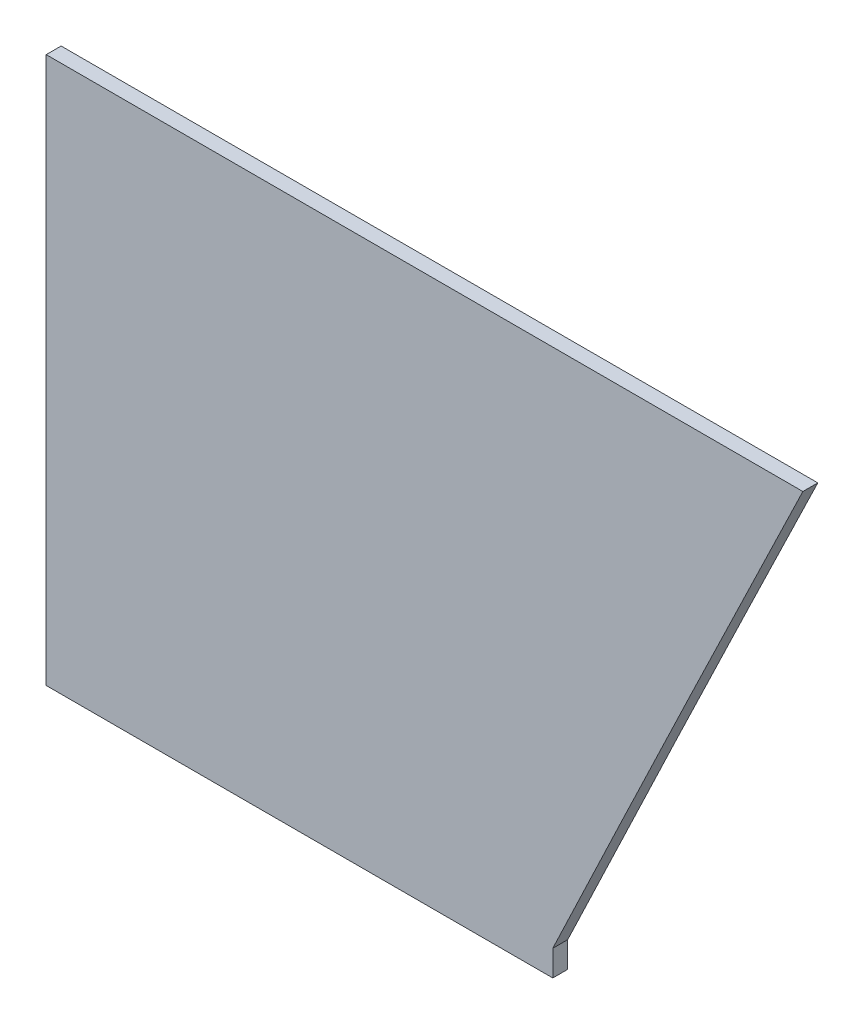
ISO-10303-21;
HEADER;
FILE_DESCRIPTION(('STEP AP214'),'2;1');
FILE_NAME('part.step','',(''),(''),'','','');
FILE_SCHEMA(('AUTOMOTIVE_DESIGN { 1 0 10303 214 1 1 1 1 }'));
ENDSEC;
DATA;
#1=APPLICATION_CONTEXT('core data for automotive mechanical design processes');
#2=APPLICATION_PROTOCOL_DEFINITION('international standard','automotive_design',2000,#1);
#3=PRODUCT_CONTEXT('',#1,'mechanical');
#4=PRODUCT('Part','Part','',(#3));
#5=PRODUCT_RELATED_PRODUCT_CATEGORY('part','',(#4));
#6=PRODUCT_DEFINITION_FORMATION('','',#4);
#7=PRODUCT_DEFINITION_CONTEXT('part definition',#1,'design');
#8=PRODUCT_DEFINITION('design','',#6,#7);
#9=PRODUCT_DEFINITION_SHAPE('','',#8);
#10=(LENGTH_UNIT() NAMED_UNIT(*) SI_UNIT(.MILLI.,.METRE.));
#11=(NAMED_UNIT(*) PLANE_ANGLE_UNIT() SI_UNIT($,.RADIAN.));
#12=(NAMED_UNIT(*) SI_UNIT($,.STERADIAN.) SOLID_ANGLE_UNIT());
#13=UNCERTAINTY_MEASURE_WITH_UNIT(LENGTH_MEASURE(1.E-05),#10,'distance_accuracy_value','');
#14=(GEOMETRIC_REPRESENTATION_CONTEXT(3) GLOBAL_UNCERTAINTY_ASSIGNED_CONTEXT((#13)) GLOBAL_UNIT_ASSIGNED_CONTEXT((#10,
#11,#12)) REPRESENTATION_CONTEXT('',''));
#15=CARTESIAN_POINT('',(0.,0.,0.));
#16=DIRECTION('',(0.,0.,1.));
#17=DIRECTION('',(1.,0.,0.));
#18=AXIS2_PLACEMENT_3D('',#15,#16,#17);
#19=CARTESIAN_POINT('',(87.3054648042855,-177.209396927069,10.16));
#20=CARTESIAN_POINT('',(115.44368723427,-118.026720575969,10.16));
#21=CARTESIAN_POINT('',(143.693138312456,-58.8972728300728,10.16));
#22=CARTESIAN_POINT('',(200.435070063612,59.2453205528402,10.16));
#23=CARTESIAN_POINT('',(228.928258607347,118.258075422165,10.16));
#24=CARTESIAN_POINT('',(257.548254827989,177.209298992135,10.16));
#25=B_SPLINE_CURVE_WITH_KNOTS('',3,(#19,#20,#21,#22,#23,#24),.UNSPECIFIED.,.F.,.F.,(4,2,4),(0.,
0.5,1.),.UNSPECIFIED.);
#26=DIRECTION('',(0.,0.,-1.));
#27=VECTOR('',#26,1.);
#28=SURFACE_OF_LINEAR_EXTRUSION('',#25,#27);
#29=CARTESIAN_POINT('',(87.3054648042855,-177.209396927069,0.));
#30=CARTESIAN_POINT('',(115.44368723427,-118.026720575969,0.));
#31=CARTESIAN_POINT('',(143.693138312456,-58.8972728300728,0.));
#32=CARTESIAN_POINT('',(200.435070063612,59.2453205528402,0.));
#33=CARTESIAN_POINT('',(228.928258607347,118.258075422165,0.));
#34=CARTESIAN_POINT('',(257.548254827989,177.209298992135,0.));
#35=B_SPLINE_CURVE_WITH_KNOTS('',3,(#29,#30,#31,#32,#33,#34),.UNSPECIFIED.,.F.,.F.,(4,2,4),(0.,
0.5,1.),.UNSPECIFIED.);
#36=CARTESIAN_POINT('',(87.3054648042855,-177.209396927068,0.));
#37=VERTEX_POINT('',#36);
#38=CARTESIAN_POINT('',(257.548254827988,177.209298992135,0.));
#39=VERTEX_POINT('',#38);
#40=EDGE_CURVE('E187',#37,#39,#35,.T.);
#41=ORIENTED_EDGE('',*,*,#40,.T.);
#42=DIRECTION('',(0.,0.,-1.));
#43=VECTOR('',#42,1.);
#44=CARTESIAN_POINT('',(257.548254827988,177.209298992135,10.16));
#45=LINE('',#44,#43);
#46=CARTESIAN_POINT('',(257.548254827988,177.209298992135,10.16));
#47=VERTEX_POINT('',#46);
#48=EDGE_CURVE('E11',#47,#39,#45,.T.);
#49=ORIENTED_EDGE('',*,*,#48,.F.);
#50=CARTESIAN_POINT('',(257.548254827989,177.209298992135,10.16));
#51=CARTESIAN_POINT('',(228.928258607347,118.258075422165,10.16));
#52=CARTESIAN_POINT('',(200.435070063612,59.2453205528402,10.16));
#53=CARTESIAN_POINT('',(143.693138312456,-58.8972728300728,10.16));
#54=CARTESIAN_POINT('',(115.44368723427,-118.026720575969,10.16));
#55=CARTESIAN_POINT('',(87.3054648042855,-177.209396927069,10.16));
#56=B_SPLINE_CURVE_WITH_KNOTS('',3,(#50,#51,#52,#53,#54,#55),.UNSPECIFIED.,.F.,.F.,(4,2,4),(0.,
0.5,1.),.UNSPECIFIED.);
#57=CARTESIAN_POINT('',(87.3054648042855,-177.209396927068,10.16));
#58=VERTEX_POINT('',#57);
#59=EDGE_CURVE('E149',#58,#47,#56,.F.);
#60=ORIENTED_EDGE('',*,*,#59,.F.);
#61=DIRECTION('',(0.,0.,-1.));
#62=VECTOR('',#61,1.);
#63=CARTESIAN_POINT('',(87.3054648042855,-177.209396927068,10.16));
#64=LINE('',#63,#62);
#65=EDGE_CURVE('E128',#58,#37,#64,.T.);
#66=ORIENTED_EDGE('',*,*,#65,.T.);
#67=EDGE_LOOP('',(#41,#49,#60,#66));
#68=FACE_BOUND('',#67,.T.);
#69=ADVANCED_FACE('F39',(#68),#28,.F.);
#70=CARTESIAN_POINT('',(257.548254827988,177.209298992135,10.16));
#71=DIRECTION('',(-1.90129327083673E-07,-0.999999999999982,0.));
#72=DIRECTION('',(0.999999999999982,-1.90129327083673E-07,0.));
#73=AXIS2_PLACEMENT_3D('',#70,#71,#72);
#74=PLANE('',#73);
#75=DIRECTION('',(-0.999999999999982,1.90129327083673E-07,0.));
#76=VECTOR('',#75,1.);
#77=CARTESIAN_POINT('',(257.548254827988,177.209298992135,0.));
#78=LINE('',#77,#76);
#79=CARTESIAN_POINT('',(-257.548120057211,177.209396927062,0.));
#80=VERTEX_POINT('',#79);
#81=EDGE_CURVE('E135',#39,#80,#78,.T.);
#82=ORIENTED_EDGE('',*,*,#81,.T.);
#83=DIRECTION('',(0.,0.,-1.));
#84=VECTOR('',#83,1.);
#85=CARTESIAN_POINT('',(-257.548120057211,177.209396927062,10.16));
#86=LINE('',#85,#84);
#87=CARTESIAN_POINT('',(-257.548120057211,177.209396927062,10.16));
#88=VERTEX_POINT('',#87);
#89=EDGE_CURVE('E51',#88,#80,#86,.T.);
#90=ORIENTED_EDGE('',*,*,#89,.F.);
#91=DIRECTION('',(-0.999999999999982,1.90129327083673E-07,0.));
#92=VECTOR('',#91,1.);
#93=CARTESIAN_POINT('',(257.548254827988,177.209298992135,10.16));
#94=LINE('',#93,#92);
#95=EDGE_CURVE('E97',#47,#88,#94,.T.);
#96=ORIENTED_EDGE('',*,*,#95,.F.);
#97=ORIENTED_EDGE('',*,*,#48,.T.);
#98=EDGE_LOOP('',(#82,#90,#96,#97));
#99=FACE_BOUND('',#98,.T.);
#100=ADVANCED_FACE('F226',(#99),#74,.F.);
#101=CARTESIAN_POINT('',(-257.548120057211,177.209396927062,10.16));
#102=DIRECTION('',(0.999999999999982,-1.90129327097578E-07,0.));
#103=DIRECTION('',(1.90129327097578E-07,0.999999999999982,0.));
#104=AXIS2_PLACEMENT_3D('',#101,#102,#103);
#105=PLANE('',#104);
#106=DIRECTION('',(-1.90129327097578E-07,-0.999999999999982,0.));
#107=VECTOR('',#106,1.);
#108=CARTESIAN_POINT('',(-257.548120057211,177.209396927062,0.));
#109=LINE('',#108,#107);
#110=CARTESIAN_POINT('',(-257.548187442605,-177.209331360276,0.));
#111=VERTEX_POINT('',#110);
#112=EDGE_CURVE('E132',#80,#111,#109,.T.);
#113=ORIENTED_EDGE('',*,*,#112,.T.);
#114=DIRECTION('',(0.,0.,-1.));
#115=VECTOR('',#114,1.);
#116=CARTESIAN_POINT('',(-257.548187442605,-177.209331360276,10.16));
#117=LINE('',#116,#115);
#118=CARTESIAN_POINT('',(-257.548187442605,-177.209331360276,10.16));
#119=VERTEX_POINT('',#118);
#120=EDGE_CURVE('E121',#119,#111,#117,.T.);
#121=ORIENTED_EDGE('',*,*,#120,.F.);
#122=DIRECTION('',(-1.90129327097578E-07,-0.999999999999982,0.));
#123=VECTOR('',#122,1.);
#124=CARTESIAN_POINT('',(-257.548120057211,177.209396927062,10.16));
#125=LINE('',#124,#123);
#126=EDGE_CURVE('E110',#88,#119,#125,.T.);
#127=ORIENTED_EDGE('',*,*,#126,.F.);
#128=ORIENTED_EDGE('',*,*,#89,.T.);
#129=EDGE_LOOP('',(#113,#121,#127,#128));
#130=FACE_BOUND('',#129,.T.);
#131=ADVANCED_FACE('F229',(#130),#105,.F.);
#132=CARTESIAN_POINT('',(-257.548187442605,-177.209331360276,10.16));
#133=DIRECTION('',(1.,0.,0.));
#134=DIRECTION('',(0.,0.,-1.));
#135=AXIS2_PLACEMENT_3D('',#132,#133,#134);
#136=PLANE('',#135);
#137=DIRECTION('',(0.,-1.,0.));
#138=VECTOR('',#137,1.);
#139=CARTESIAN_POINT('',(-257.548187442605,-177.209331360276,0.));
#140=LINE('',#139,#138);
#141=CARTESIAN_POINT('',(-257.548187442605,-194.735331360276,0.));
#142=VERTEX_POINT('',#141);
#143=EDGE_CURVE('E119',#111,#142,#140,.T.);
#144=ORIENTED_EDGE('',*,*,#143,.T.);
#145=DIRECTION('',(0.,0.,-1.));
#146=VECTOR('',#145,1.);
#147=CARTESIAN_POINT('',(-257.548187442605,-194.735331360276,10.16));
#148=LINE('',#147,#146);
#149=CARTESIAN_POINT('',(-257.548187442605,-194.735331360276,10.16));
#150=VERTEX_POINT('',#149);
#151=EDGE_CURVE('E116',#150,#142,#148,.T.);
#152=ORIENTED_EDGE('',*,*,#151,.F.);
#153=DIRECTION('',(0.,-1.,0.));
#154=VECTOR('',#153,1.);
#155=CARTESIAN_POINT('',(-257.548187442605,-177.209331360276,10.16));
#156=LINE('',#155,#154);
#157=EDGE_CURVE('E104',#119,#150,#156,.T.);
#158=ORIENTED_EDGE('',*,*,#157,.F.);
#159=ORIENTED_EDGE('',*,*,#120,.T.);
#160=EDGE_LOOP('',(#144,#152,#158,#159));
#161=FACE_BOUND('',#160,.T.);
#162=ADVANCED_FACE('F117',(#161),#136,.F.);
#163=CARTESIAN_POINT('',(-257.548187442605,-194.735331360276,10.16));
#164=DIRECTION('',(0.,1.,0.));
#165=DIRECTION('',(0.,0.,1.));
#166=AXIS2_PLACEMENT_3D('',#163,#164,#165);
#167=PLANE('',#166);
#168=DIRECTION('',(1.,0.,0.));
#169=VECTOR('',#168,1.);
#170=CARTESIAN_POINT('',(-257.548187442605,-194.735331360276,0.));
#171=LINE('',#170,#169);
#172=CARTESIAN_POINT('',(87.3054648042855,-194.735331360276,0.));
#173=VERTEX_POINT('',#172);
#174=EDGE_CURVE('E83',#142,#173,#171,.T.);
#175=ORIENTED_EDGE('',*,*,#174,.T.);
#176=DIRECTION('',(0.,0.,-1.));
#177=VECTOR('',#176,1.);
#178=CARTESIAN_POINT('',(87.3054648042855,-194.735331360276,10.16));
#179=LINE('',#178,#177);
#180=CARTESIAN_POINT('',(87.3054648042855,-194.735331360276,10.16));
#181=VERTEX_POINT('',#180);
#182=EDGE_CURVE('E122',#181,#173,#179,.T.);
#183=ORIENTED_EDGE('',*,*,#182,.F.);
#184=DIRECTION('',(1.,0.,0.));
#185=VECTOR('',#184,1.);
#186=CARTESIAN_POINT('',(-257.548187442605,-194.735331360276,10.16));
#187=LINE('',#186,#185);
#188=EDGE_CURVE('E108',#150,#181,#187,.T.);
#189=ORIENTED_EDGE('',*,*,#188,.F.);
#190=ORIENTED_EDGE('',*,*,#151,.T.);
#191=EDGE_LOOP('',(#175,#183,#189,#190));
#192=FACE_BOUND('',#191,.T.);
#193=ADVANCED_FACE('F124',(#192),#167,.F.);
#194=CARTESIAN_POINT('',(87.3054648042855,-194.735331360276,10.16));
#195=DIRECTION('',(-1.,0.,0.));
#196=DIRECTION('',(0.,0.,1.));
#197=AXIS2_PLACEMENT_3D('',#194,#195,#196);
#198=PLANE('',#197);
#199=DIRECTION('',(0.,1.,0.));
#200=VECTOR('',#199,1.);
#201=CARTESIAN_POINT('',(87.3054648042855,-194.735331360276,0.));
#202=LINE('',#201,#200);
#203=EDGE_CURVE('E89',#173,#37,#202,.T.);
#204=ORIENTED_EDGE('',*,*,#203,.T.);
#205=ORIENTED_EDGE('',*,*,#65,.F.);
#206=DIRECTION('',(0.,1.,0.));
#207=VECTOR('',#206,1.);
#208=CARTESIAN_POINT('',(87.3054648042855,-194.735331360276,10.16));
#209=LINE('',#208,#207);
#210=EDGE_CURVE('E60',#181,#58,#209,.T.);
#211=ORIENTED_EDGE('',*,*,#210,.F.);
#212=ORIENTED_EDGE('',*,*,#182,.T.);
#213=EDGE_LOOP('',(#204,#205,#211,#212));
#214=FACE_BOUND('',#213,.T.);
#215=ADVANCED_FACE('F165',(#214),#198,.F.);
#216=CARTESIAN_POINT('',(172.064104188034,0.174023861383699,10.16));
#217=DIRECTION('',(0.,0.,1.));
#218=DIRECTION('',(1.,0.,0.));
#219=AXIS2_PLACEMENT_3D('',#216,#217,#218);
#220=PLANE('',#219);
#221=ORIENTED_EDGE('',*,*,#59,.T.);
#222=ORIENTED_EDGE('',*,*,#95,.T.);
#223=ORIENTED_EDGE('',*,*,#126,.T.);
#224=ORIENTED_EDGE('',*,*,#157,.T.);
#225=ORIENTED_EDGE('',*,*,#188,.T.);
#226=ORIENTED_EDGE('',*,*,#210,.T.);
#227=EDGE_LOOP('',(#221,#222,#223,#224,#225,#226));
#228=FACE_BOUND('',#227,.T.);
#229=ADVANCED_FACE('F106',(#228),#220,.T.);
#230=CARTESIAN_POINT('',(172.064104188034,0.174023861383699,0.));
#231=DIRECTION('',(0.,0.,1.));
#232=DIRECTION('',(1.,0.,0.));
#233=AXIS2_PLACEMENT_3D('',#230,#231,#232);
#234=PLANE('',#233);
#235=ORIENTED_EDGE('',*,*,#40,.F.);
#236=ORIENTED_EDGE('',*,*,#203,.F.);
#237=ORIENTED_EDGE('',*,*,#174,.F.);
#238=ORIENTED_EDGE('',*,*,#143,.F.);
#239=ORIENTED_EDGE('',*,*,#112,.F.);
#240=ORIENTED_EDGE('',*,*,#81,.F.);
#241=EDGE_LOOP('',(#235,#236,#237,#238,#239,#240));
#242=FACE_BOUND('',#241,.T.);
#243=ADVANCED_FACE('F164',(#242),#234,.F.);
#244=CLOSED_SHELL('',(#69,#100,#131,#162,#193,#215,#229,#243));
#245=MANIFOLD_SOLID_BREP('B2',#244);
#246=ADVANCED_BREP_SHAPE_REPRESENTATION('',(#18,#245),#14);
#247=SHAPE_DEFINITION_REPRESENTATION(#9,#246);
ENDSEC;
END-ISO-10303-21;
